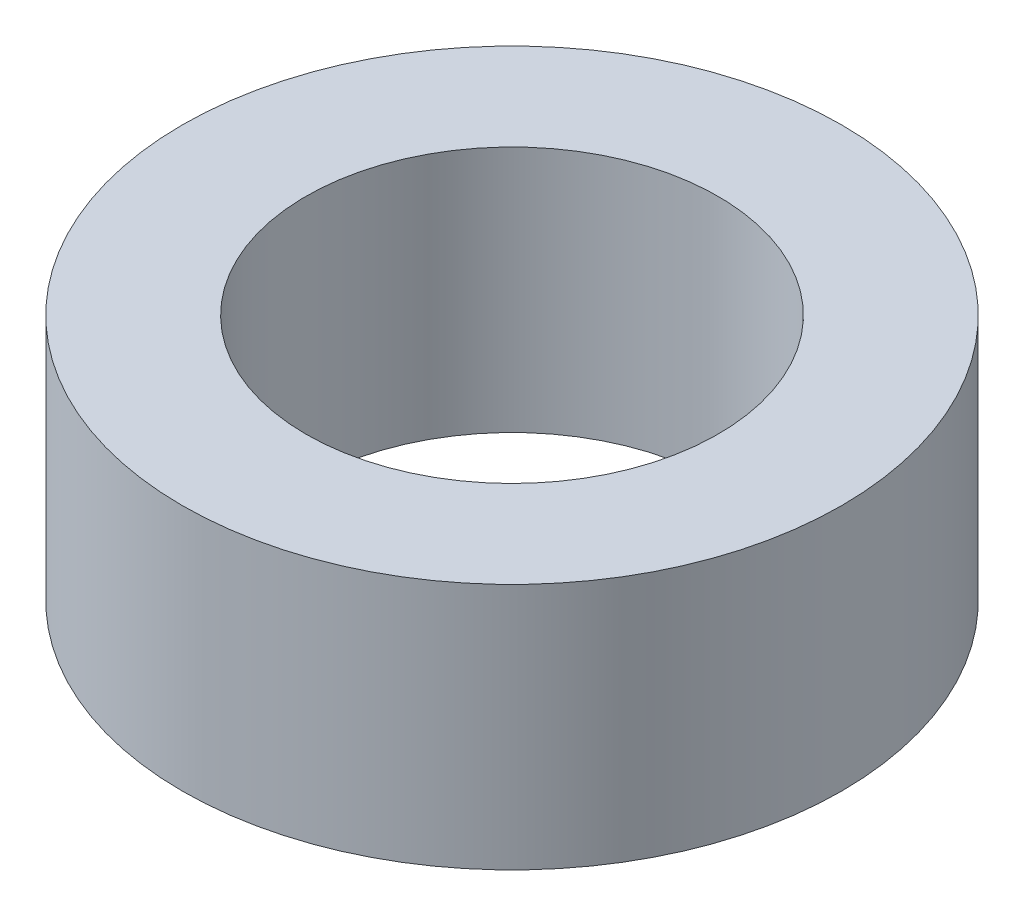
ISO-10303-21;
HEADER;
FILE_DESCRIPTION(('STEP AP214'),'2;1');
FILE_NAME('part.step','',(''),(''),'','','');
FILE_SCHEMA(('AUTOMOTIVE_DESIGN { 1 0 10303 214 1 1 1 1 }'));
ENDSEC;
DATA;
#1=APPLICATION_CONTEXT('core data for automotive mechanical design processes');
#2=APPLICATION_PROTOCOL_DEFINITION('international standard','automotive_design',2000,#1);
#3=PRODUCT_CONTEXT('',#1,'mechanical');
#4=PRODUCT('Part','Part','',(#3));
#5=PRODUCT_RELATED_PRODUCT_CATEGORY('part','',(#4));
#6=PRODUCT_DEFINITION_FORMATION('','',#4);
#7=PRODUCT_DEFINITION_CONTEXT('part definition',#1,'design');
#8=PRODUCT_DEFINITION('design','',#6,#7);
#9=PRODUCT_DEFINITION_SHAPE('','',#8);
#10=(LENGTH_UNIT() NAMED_UNIT(*) SI_UNIT(.MILLI.,.METRE.));
#11=(NAMED_UNIT(*) PLANE_ANGLE_UNIT() SI_UNIT($,.RADIAN.));
#12=(NAMED_UNIT(*) SI_UNIT($,.STERADIAN.) SOLID_ANGLE_UNIT());
#13=UNCERTAINTY_MEASURE_WITH_UNIT(LENGTH_MEASURE(1.E-05),#10,'distance_accuracy_value','');
#14=(GEOMETRIC_REPRESENTATION_CONTEXT(3) GLOBAL_UNCERTAINTY_ASSIGNED_CONTEXT((#13)) GLOBAL_UNIT_ASSIGNED_CONTEXT((#10,
#11,#12)) REPRESENTATION_CONTEXT('',''));
#15=CARTESIAN_POINT('',(0.,0.,0.));
#16=DIRECTION('',(0.,0.,1.));
#17=DIRECTION('',(1.,0.,0.));
#18=AXIS2_PLACEMENT_3D('',#15,#16,#17);
#19=CARTESIAN_POINT('',(0.,3.,0.));
#20=DIRECTION('',(0.,1.,0.));
#21=DIRECTION('',(0.,0.,1.));
#22=AXIS2_PLACEMENT_3D('',#19,#20,#21);
#23=PLANE('',#22);
#24=CARTESIAN_POINT('',(0.,3.,0.));
#25=DIRECTION('',(0.,1.,0.));
#26=DIRECTION('',(0.,0.,1.));
#27=AXIS2_PLACEMENT_3D('',#24,#25,#26);
#28=CIRCLE('',#27,4.);
#29=CARTESIAN_POINT('',(0.,3.,4.));
#30=VERTEX_POINT('',#29);
#31=EDGE_CURVE('E10',#30,#30,#28,.T.);
#32=ORIENTED_EDGE('',*,*,#31,.T.);
#33=EDGE_LOOP('',(#32));
#34=FACE_BOUND('',#33,.T.);
#35=CARTESIAN_POINT('',(0.,3.,0.));
#36=DIRECTION('',(0.,1.,0.));
#37=DIRECTION('',(0.,0.,1.));
#38=AXIS2_PLACEMENT_3D('',#35,#36,#37);
#39=CIRCLE('',#38,2.5);
#40=CARTESIAN_POINT('',(0.,3.,2.5));
#41=VERTEX_POINT('',#40);
#42=EDGE_CURVE('E53',#41,#41,#39,.T.);
#43=ORIENTED_EDGE('',*,*,#42,.F.);
#44=EDGE_LOOP('',(#43));
#45=FACE_BOUND('',#44,.T.);
#46=ADVANCED_FACE('F38',(#34,#45),#23,.T.);
#47=CARTESIAN_POINT('',(0.,0.,0.));
#48=DIRECTION('',(0.,1.,0.));
#49=DIRECTION('',(0.,0.,1.));
#50=AXIS2_PLACEMENT_3D('',#47,#48,#49);
#51=PLANE('',#50);
#52=CARTESIAN_POINT('',(0.,0.,0.));
#53=DIRECTION('',(0.,1.,0.));
#54=DIRECTION('',(0.,0.,1.));
#55=AXIS2_PLACEMENT_3D('',#52,#53,#54);
#56=CIRCLE('',#55,4.);
#57=CARTESIAN_POINT('',(0.,0.,4.));
#58=VERTEX_POINT('',#57);
#59=EDGE_CURVE('E42',#58,#58,#56,.T.);
#60=ORIENTED_EDGE('',*,*,#59,.F.);
#61=EDGE_LOOP('',(#60));
#62=FACE_BOUND('',#61,.T.);
#63=CARTESIAN_POINT('',(0.,0.,0.));
#64=DIRECTION('',(0.,1.,0.));
#65=DIRECTION('',(0.,0.,1.));
#66=AXIS2_PLACEMENT_3D('',#63,#64,#65);
#67=CIRCLE('',#66,2.5);
#68=CARTESIAN_POINT('',(0.,0.,2.5));
#69=VERTEX_POINT('',#68);
#70=EDGE_CURVE('E55',#69,#69,#67,.T.);
#71=ORIENTED_EDGE('',*,*,#70,.T.);
#72=EDGE_LOOP('',(#71));
#73=FACE_BOUND('',#72,.T.);
#74=ADVANCED_FACE('F65',(#62,#73),#51,.F.);
#75=CARTESIAN_POINT('',(0.,3.,0.));
#76=DIRECTION('',(0.,-1.,0.));
#77=DIRECTION('',(0.,0.,-1.));
#78=AXIS2_PLACEMENT_3D('',#75,#76,#77);
#79=CYLINDRICAL_SURFACE('',#78,4.);
#80=ORIENTED_EDGE('',*,*,#31,.F.);
#81=EDGE_LOOP('',(#80));
#82=FACE_BOUND('',#81,.T.);
#83=ORIENTED_EDGE('',*,*,#59,.T.);
#84=EDGE_LOOP('',(#83));
#85=FACE_BOUND('',#84,.T.);
#86=ADVANCED_FACE('F40',(#82,#85),#79,.T.);
#87=CARTESIAN_POINT('',(0.,3.,0.));
#88=DIRECTION('',(0.,-1.,0.));
#89=DIRECTION('',(0.,0.,-1.));
#90=AXIS2_PLACEMENT_3D('',#87,#88,#89);
#91=CYLINDRICAL_SURFACE('',#90,2.5);
#92=ORIENTED_EDGE('',*,*,#42,.T.);
#93=EDGE_LOOP('',(#92));
#94=FACE_BOUND('',#93,.T.);
#95=ORIENTED_EDGE('',*,*,#70,.F.);
#96=EDGE_LOOP('',(#95));
#97=FACE_BOUND('',#96,.T.);
#98=ADVANCED_FACE('F61',(#94,#97),#91,.F.);
#99=CLOSED_SHELL('',(#46,#74,#86,#98));
#100=MANIFOLD_SOLID_BREP('B2',#99);
#101=ADVANCED_BREP_SHAPE_REPRESENTATION('',(#18,#100),#14);
#102=SHAPE_DEFINITION_REPRESENTATION(#9,#101);
ENDSEC;
END-ISO-10303-21;
